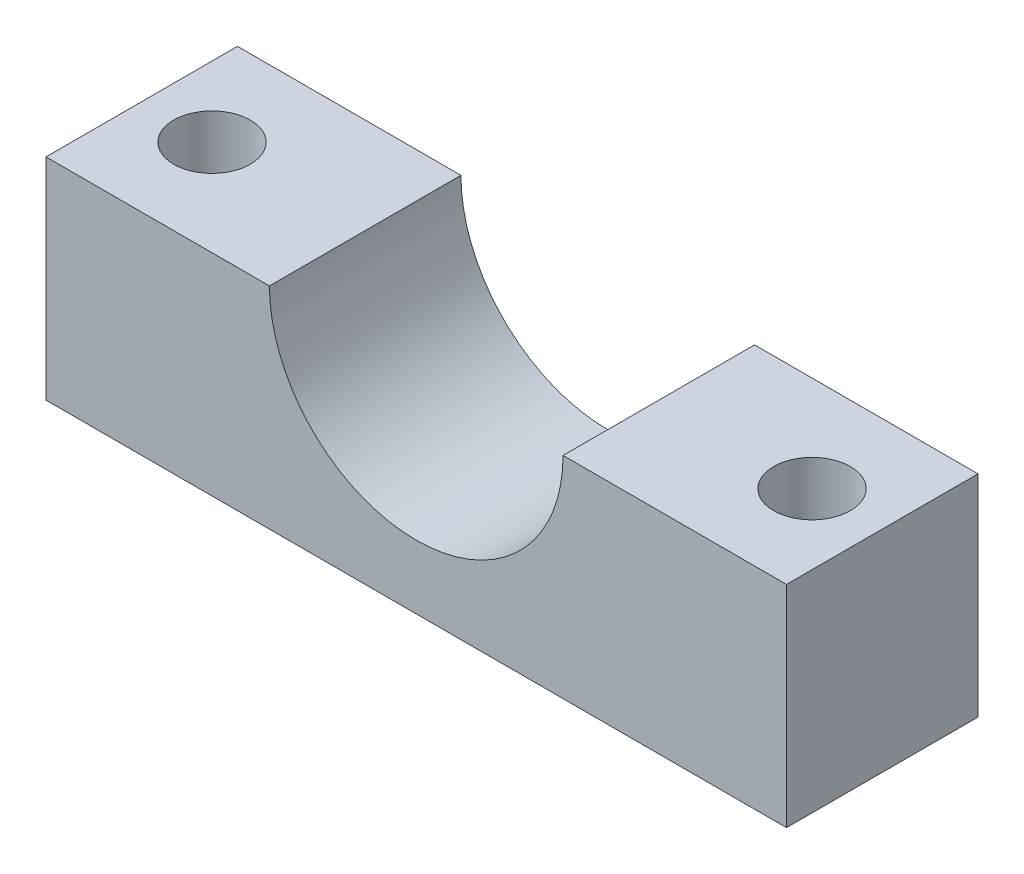
ISO-10303-21;
HEADER;
FILE_DESCRIPTION(('STEP AP214'),'2;1');
FILE_NAME('part.step','',(''),(''),'','','');
FILE_SCHEMA(('AUTOMOTIVE_DESIGN { 1 0 10303 214 1 1 1 1 }'));
ENDSEC;
DATA;
#1=APPLICATION_CONTEXT('core data for automotive mechanical design processes');
#2=APPLICATION_PROTOCOL_DEFINITION('international standard','automotive_design',2000,#1);
#3=PRODUCT_CONTEXT('',#1,'mechanical');
#4=PRODUCT('Part','Part','',(#3));
#5=PRODUCT_RELATED_PRODUCT_CATEGORY('part','',(#4));
#6=PRODUCT_DEFINITION_FORMATION('','',#4);
#7=PRODUCT_DEFINITION_CONTEXT('part definition',#1,'design');
#8=PRODUCT_DEFINITION('design','',#6,#7);
#9=PRODUCT_DEFINITION_SHAPE('','',#8);
#10=(LENGTH_UNIT() NAMED_UNIT(*) SI_UNIT(.MILLI.,.METRE.));
#11=(NAMED_UNIT(*) PLANE_ANGLE_UNIT() SI_UNIT($,.RADIAN.));
#12=(NAMED_UNIT(*) SI_UNIT($,.STERADIAN.) SOLID_ANGLE_UNIT());
#13=UNCERTAINTY_MEASURE_WITH_UNIT(LENGTH_MEASURE(1.E-05),#10,'distance_accuracy_value','');
#14=(GEOMETRIC_REPRESENTATION_CONTEXT(3) GLOBAL_UNCERTAINTY_ASSIGNED_CONTEXT((#13)) GLOBAL_UNIT_ASSIGNED_CONTEXT((#10,
#11,#12)) REPRESENTATION_CONTEXT('',''));
#15=CARTESIAN_POINT('',(0.,0.,0.));
#16=DIRECTION('',(0.,0.,1.));
#17=DIRECTION('',(1.,0.,0.));
#18=AXIS2_PLACEMENT_3D('',#15,#16,#17);
#19=CARTESIAN_POINT('',(0.,0.,15.));
#20=DIRECTION('',(0.,0.,-1.));
#21=DIRECTION('',(-1.,0.,0.));
#22=AXIS2_PLACEMENT_3D('',#19,#20,#21);
#23=CYLINDRICAL_SURFACE('',#22,11.5);
#24=CARTESIAN_POINT('',(0.,0.,0.));
#25=DIRECTION('',(0.,0.,-1.));
#26=DIRECTION('',(1.,0.,0.));
#27=AXIS2_PLACEMENT_3D('',#24,#25,#26);
#28=CIRCLE('',#27,11.5);
#29=CARTESIAN_POINT('',(11.5,0.,0.));
#30=VERTEX_POINT('',#29);
#31=CARTESIAN_POINT('',(-11.5,0.,0.));
#32=VERTEX_POINT('',#31);
#33=EDGE_CURVE('E124',#30,#32,#28,.T.);
#34=ORIENTED_EDGE('',*,*,#33,.T.);
#35=DIRECTION('',(0.,0.,-1.));
#36=VECTOR('',#35,1.);
#37=CARTESIAN_POINT('',(-11.5,0.,15.));
#38=LINE('',#37,#36);
#39=CARTESIAN_POINT('',(-11.5,0.,15.));
#40=VERTEX_POINT('',#39);
#41=EDGE_CURVE('E11',#40,#32,#38,.T.);
#42=ORIENTED_EDGE('',*,*,#41,.F.);
#43=CARTESIAN_POINT('',(0.,0.,15.));
#44=DIRECTION('',(0.,0.,-1.));
#45=DIRECTION('',(1.,0.,0.));
#46=AXIS2_PLACEMENT_3D('',#43,#44,#45);
#47=CIRCLE('',#46,11.5);
#48=CARTESIAN_POINT('',(11.5,0.,15.));
#49=VERTEX_POINT('',#48);
#50=EDGE_CURVE('E135',#49,#40,#47,.T.);
#51=ORIENTED_EDGE('',*,*,#50,.F.);
#52=DIRECTION('',(0.,0.,-1.));
#53=VECTOR('',#52,1.);
#54=CARTESIAN_POINT('',(11.5,0.,15.));
#55=LINE('',#54,#53);
#56=EDGE_CURVE('E120',#49,#30,#55,.T.);
#57=ORIENTED_EDGE('',*,*,#56,.T.);
#58=EDGE_LOOP('',(#34,#42,#51,#57));
#59=FACE_BOUND('',#58,.T.);
#60=ADVANCED_FACE('F37',(#59),#23,.F.);
#61=CARTESIAN_POINT('',(-11.5,0.,15.));
#62=DIRECTION('',(0.,-1.,0.));
#63=DIRECTION('',(1.,0.,0.));
#64=AXIS2_PLACEMENT_3D('',#61,#62,#63);
#65=PLANE('',#64);
#66=CARTESIAN_POINT('',(-23.5,0.,7.5));
#67=DIRECTION('',(0.,1.,0.));
#68=DIRECTION('',(0.,0.,1.));
#69=AXIS2_PLACEMENT_3D('',#66,#67,#68);
#70=CIRCLE('',#69,2.99999999999999);
#71=CARTESIAN_POINT('',(-23.5,0.,10.5));
#72=VERTEX_POINT('',#71);
#73=EDGE_CURVE('E255',#72,#72,#70,.T.);
#74=ORIENTED_EDGE('',*,*,#73,.F.);
#75=EDGE_LOOP('',(#74));
#76=FACE_BOUND('',#75,.T.);
#77=DIRECTION('',(-1.,0.,0.));
#78=VECTOR('',#77,1.);
#79=CARTESIAN_POINT('',(-11.5,0.,0.));
#80=LINE('',#79,#78);
#81=CARTESIAN_POINT('',(-29.,0.,0.));
#82=VERTEX_POINT('',#81);
#83=EDGE_CURVE('E127',#32,#82,#80,.T.);
#84=ORIENTED_EDGE('',*,*,#83,.T.);
#85=DIRECTION('',(0.,0.,-1.));
#86=VECTOR('',#85,1.);
#87=CARTESIAN_POINT('',(-29.,0.,15.));
#88=LINE('',#87,#86);
#89=CARTESIAN_POINT('',(-29.,0.,15.));
#90=VERTEX_POINT('',#89);
#91=EDGE_CURVE('E45',#90,#82,#88,.T.);
#92=ORIENTED_EDGE('',*,*,#91,.F.);
#93=DIRECTION('',(-1.,0.,0.));
#94=VECTOR('',#93,1.);
#95=CARTESIAN_POINT('',(-11.5,0.,15.));
#96=LINE('',#95,#94);
#97=EDGE_CURVE('E91',#40,#90,#96,.T.);
#98=ORIENTED_EDGE('',*,*,#97,.F.);
#99=ORIENTED_EDGE('',*,*,#41,.T.);
#100=EDGE_LOOP('',(#84,#92,#98,#99));
#101=FACE_BOUND('',#100,.T.);
#102=ADVANCED_FACE('F161',(#76,#101),#65,.F.);
#103=CARTESIAN_POINT('',(-29.,0.,15.));
#104=DIRECTION('',(1.,0.,0.));
#105=DIRECTION('',(0.,1.,0.));
#106=AXIS2_PLACEMENT_3D('',#103,#104,#105);
#107=PLANE('',#106);
#108=DIRECTION('',(0.,-1.,0.));
#109=VECTOR('',#108,1.);
#110=CARTESIAN_POINT('',(-29.,0.,0.));
#111=LINE('',#110,#109);
#112=CARTESIAN_POINT('',(-29.,-16.5,0.));
#113=VERTEX_POINT('',#112);
#114=EDGE_CURVE('E130',#82,#113,#111,.T.);
#115=ORIENTED_EDGE('',*,*,#114,.T.);
#116=DIRECTION('',(0.,0.,-1.));
#117=VECTOR('',#116,1.);
#118=CARTESIAN_POINT('',(-29.,-16.5,15.));
#119=LINE('',#118,#117);
#120=CARTESIAN_POINT('',(-29.,-16.5,15.));
#121=VERTEX_POINT('',#120);
#122=EDGE_CURVE('E115',#121,#113,#119,.T.);
#123=ORIENTED_EDGE('',*,*,#122,.F.);
#124=DIRECTION('',(0.,-1.,0.));
#125=VECTOR('',#124,1.);
#126=CARTESIAN_POINT('',(-29.,0.,15.));
#127=LINE('',#126,#125);
#128=EDGE_CURVE('E106',#90,#121,#127,.T.);
#129=ORIENTED_EDGE('',*,*,#128,.F.);
#130=ORIENTED_EDGE('',*,*,#91,.T.);
#131=EDGE_LOOP('',(#115,#123,#129,#130));
#132=FACE_BOUND('',#131,.T.);
#133=ADVANCED_FACE('F141',(#132),#107,.F.);
#134=CARTESIAN_POINT('',(-29.,-16.5,15.));
#135=DIRECTION('',(0.,1.,0.));
#136=DIRECTION('',(0.,0.,1.));
#137=AXIS2_PLACEMENT_3D('',#134,#135,#136);
#138=PLANE('',#137);
#139=DIRECTION('',(1.,0.,0.));
#140=VECTOR('',#139,1.);
#141=CARTESIAN_POINT('',(-29.,-16.5,0.));
#142=LINE('',#141,#140);
#143=CARTESIAN_POINT('',(29.,-16.5,0.));
#144=VERTEX_POINT('',#143);
#145=EDGE_CURVE('E114',#113,#144,#142,.T.);
#146=ORIENTED_EDGE('',*,*,#145,.T.);
#147=DIRECTION('',(0.,0.,-1.));
#148=VECTOR('',#147,1.);
#149=CARTESIAN_POINT('',(29.,-16.5,15.));
#150=LINE('',#149,#148);
#151=CARTESIAN_POINT('',(29.,-16.5,15.));
#152=VERTEX_POINT('',#151);
#153=EDGE_CURVE('E111',#152,#144,#150,.T.);
#154=ORIENTED_EDGE('',*,*,#153,.F.);
#155=DIRECTION('',(1.,0.,0.));
#156=VECTOR('',#155,1.);
#157=CARTESIAN_POINT('',(-29.,-16.5,15.));
#158=LINE('',#157,#156);
#159=EDGE_CURVE('E100',#121,#152,#158,.T.);
#160=ORIENTED_EDGE('',*,*,#159,.F.);
#161=ORIENTED_EDGE('',*,*,#122,.T.);
#162=EDGE_LOOP('',(#146,#154,#160,#161));
#163=FACE_BOUND('',#162,.T.);
#164=ADVANCED_FACE('F112',(#163),#138,.F.);
#165=CARTESIAN_POINT('',(29.,-16.5,15.));
#166=DIRECTION('',(-1.,0.,0.));
#167=DIRECTION('',(0.,0.,1.));
#168=AXIS2_PLACEMENT_3D('',#165,#166,#167);
#169=PLANE('',#168);
#170=DIRECTION('',(0.,1.,0.));
#171=VECTOR('',#170,1.);
#172=CARTESIAN_POINT('',(29.,-16.5,0.));
#173=LINE('',#172,#171);
#174=CARTESIAN_POINT('',(29.,0.,0.));
#175=VERTEX_POINT('',#174);
#176=EDGE_CURVE('E77',#144,#175,#173,.T.);
#177=ORIENTED_EDGE('',*,*,#176,.T.);
#178=DIRECTION('',(0.,0.,-1.));
#179=VECTOR('',#178,1.);
#180=CARTESIAN_POINT('',(29.,0.,15.));
#181=LINE('',#180,#179);
#182=CARTESIAN_POINT('',(29.,0.,15.));
#183=VERTEX_POINT('',#182);
#184=EDGE_CURVE('E116',#183,#175,#181,.T.);
#185=ORIENTED_EDGE('',*,*,#184,.F.);
#186=DIRECTION('',(0.,1.,0.));
#187=VECTOR('',#186,1.);
#188=CARTESIAN_POINT('',(29.,-16.5,15.));
#189=LINE('',#188,#187);
#190=EDGE_CURVE('E104',#152,#183,#189,.T.);
#191=ORIENTED_EDGE('',*,*,#190,.F.);
#192=ORIENTED_EDGE('',*,*,#153,.T.);
#193=EDGE_LOOP('',(#177,#185,#191,#192));
#194=FACE_BOUND('',#193,.T.);
#195=ADVANCED_FACE('F118',(#194),#169,.F.);
#196=CARTESIAN_POINT('',(29.,0.,15.));
#197=DIRECTION('',(0.,-1.,0.));
#198=DIRECTION('',(1.,0.,0.));
#199=AXIS2_PLACEMENT_3D('',#196,#197,#198);
#200=PLANE('',#199);
#201=CARTESIAN_POINT('',(23.5,0.,7.5));
#202=DIRECTION('',(0.,1.,0.));
#203=DIRECTION('',(0.,0.,1.));
#204=AXIS2_PLACEMENT_3D('',#201,#202,#203);
#205=CIRCLE('',#204,2.99999999999999);
#206=CARTESIAN_POINT('',(23.5,0.,10.5));
#207=VERTEX_POINT('',#206);
#208=EDGE_CURVE('E253',#207,#207,#205,.T.);
#209=ORIENTED_EDGE('',*,*,#208,.F.);
#210=EDGE_LOOP('',(#209));
#211=FACE_BOUND('',#210,.T.);
#212=DIRECTION('',(-1.,0.,0.));
#213=VECTOR('',#212,1.);
#214=CARTESIAN_POINT('',(29.,0.,0.));
#215=LINE('',#214,#213);
#216=EDGE_CURVE('E83',#175,#30,#215,.T.);
#217=ORIENTED_EDGE('',*,*,#216,.T.);
#218=ORIENTED_EDGE('',*,*,#56,.F.);
#219=DIRECTION('',(-1.,0.,0.));
#220=VECTOR('',#219,1.);
#221=CARTESIAN_POINT('',(29.,0.,15.));
#222=LINE('',#221,#220);
#223=EDGE_CURVE('E53',#183,#49,#222,.T.);
#224=ORIENTED_EDGE('',*,*,#223,.F.);
#225=ORIENTED_EDGE('',*,*,#184,.T.);
#226=EDGE_LOOP('',(#217,#218,#224,#225));
#227=FACE_BOUND('',#226,.T.);
#228=ADVANCED_FACE('F148',(#211,#227),#200,.F.);
#229=CARTESIAN_POINT('',(0.,0.,15.));
#230=DIRECTION('',(0.,0.,1.));
#231=DIRECTION('',(1.,0.,0.));
#232=AXIS2_PLACEMENT_3D('',#229,#230,#231);
#233=PLANE('',#232);
#234=ORIENTED_EDGE('',*,*,#50,.T.);
#235=ORIENTED_EDGE('',*,*,#97,.T.);
#236=ORIENTED_EDGE('',*,*,#128,.T.);
#237=ORIENTED_EDGE('',*,*,#159,.T.);
#238=ORIENTED_EDGE('',*,*,#190,.T.);
#239=ORIENTED_EDGE('',*,*,#223,.T.);
#240=EDGE_LOOP('',(#234,#235,#236,#237,#238,#239));
#241=FACE_BOUND('',#240,.T.);
#242=ADVANCED_FACE('F102',(#241),#233,.T.);
#243=CARTESIAN_POINT('',(0.,0.,0.));
#244=DIRECTION('',(0.,0.,1.));
#245=DIRECTION('',(1.,0.,0.));
#246=AXIS2_PLACEMENT_3D('',#243,#244,#245);
#247=PLANE('',#246);
#248=ORIENTED_EDGE('',*,*,#33,.F.);
#249=ORIENTED_EDGE('',*,*,#216,.F.);
#250=ORIENTED_EDGE('',*,*,#176,.F.);
#251=ORIENTED_EDGE('',*,*,#145,.F.);
#252=ORIENTED_EDGE('',*,*,#114,.F.);
#253=ORIENTED_EDGE('',*,*,#83,.F.);
#254=EDGE_LOOP('',(#248,#249,#250,#251,#252,#253));
#255=FACE_BOUND('',#254,.T.);
#256=ADVANCED_FACE('F144',(#255),#247,.F.);
#257=CARTESIAN_POINT('',(-23.5,-10.,7.5));
#258=DIRECTION('',(0.,1.,0.));
#259=DIRECTION('',(0.,0.,1.));
#260=AXIS2_PLACEMENT_3D('',#257,#258,#259);
#261=CONICAL_SURFACE('',#260,3.,1.02974425867665);
#262=CARTESIAN_POINT('',(-23.5,-11.8025818570827,7.5));
#263=VERTEX_POINT('',#262);
#264=VERTEX_LOOP('',#263);
#265=FACE_BOUND('',#264,.T.);
#266=CARTESIAN_POINT('',(-23.5,-10.,7.5));
#267=DIRECTION('',(0.,1.,0.));
#268=DIRECTION('',(0.,0.,1.));
#269=AXIS2_PLACEMENT_3D('',#266,#267,#268);
#270=CIRCLE('',#269,3.);
#271=CARTESIAN_POINT('',(-23.5,-10.,10.5));
#272=VERTEX_POINT('',#271);
#273=EDGE_CURVE('E128',#272,#272,#270,.T.);
#274=ORIENTED_EDGE('',*,*,#273,.T.);
#275=EDGE_LOOP('',(#274));
#276=FACE_BOUND('',#275,.T.);
#277=ADVANCED_FACE('F196',(#265,#276),#261,.F.);
#278=CARTESIAN_POINT('',(-23.5,0.,7.5));
#279=DIRECTION('',(0.,1.,0.));
#280=DIRECTION('',(0.,0.,1.));
#281=AXIS2_PLACEMENT_3D('',#278,#279,#280);
#282=CYLINDRICAL_SURFACE('',#281,2.99999999999999);
#283=ORIENTED_EDGE('',*,*,#273,.F.);
#284=EDGE_LOOP('',(#283));
#285=FACE_BOUND('',#284,.T.);
#286=ORIENTED_EDGE('',*,*,#73,.T.);
#287=EDGE_LOOP('',(#286));
#288=FACE_BOUND('',#287,.T.);
#289=ADVANCED_FACE('F211',(#285,#288),#282,.F.);
#290=CARTESIAN_POINT('',(23.5,-10.,7.5));
#291=DIRECTION('',(0.,1.,0.));
#292=DIRECTION('',(0.,0.,1.));
#293=AXIS2_PLACEMENT_3D('',#290,#291,#292);
#294=CONICAL_SURFACE('',#293,3.,1.02974425867665);
#295=CARTESIAN_POINT('',(23.5,-11.8025818570827,7.5));
#296=VERTEX_POINT('',#295);
#297=VERTEX_LOOP('',#296);
#298=FACE_BOUND('',#297,.T.);
#299=CARTESIAN_POINT('',(23.5,-10.,7.5));
#300=DIRECTION('',(0.,1.,0.));
#301=DIRECTION('',(0.,0.,1.));
#302=AXIS2_PLACEMENT_3D('',#299,#300,#301);
#303=CIRCLE('',#302,3.);
#304=CARTESIAN_POINT('',(23.5,-10.,10.5));
#305=VERTEX_POINT('',#304);
#306=EDGE_CURVE('E251',#305,#305,#303,.T.);
#307=ORIENTED_EDGE('',*,*,#306,.T.);
#308=EDGE_LOOP('',(#307));
#309=FACE_BOUND('',#308,.T.);
#310=ADVANCED_FACE('F220',(#298,#309),#294,.F.);
#311=CARTESIAN_POINT('',(23.5,0.,7.5));
#312=DIRECTION('',(0.,1.,0.));
#313=DIRECTION('',(0.,0.,1.));
#314=AXIS2_PLACEMENT_3D('',#311,#312,#313);
#315=CYLINDRICAL_SURFACE('',#314,2.99999999999999);
#316=ORIENTED_EDGE('',*,*,#306,.F.);
#317=EDGE_LOOP('',(#316));
#318=FACE_BOUND('',#317,.T.);
#319=ORIENTED_EDGE('',*,*,#208,.T.);
#320=EDGE_LOOP('',(#319));
#321=FACE_BOUND('',#320,.T.);
#322=ADVANCED_FACE('F234',(#318,#321),#315,.F.);
#323=CLOSED_SHELL('',(#60,#102,#133,#164,#195,#228,#242,#256,#277,#289,#310,#322));
#324=MANIFOLD_SOLID_BREP('B2',#323);
#325=ADVANCED_BREP_SHAPE_REPRESENTATION('',(#18,#324),#14);
#326=SHAPE_DEFINITION_REPRESENTATION(#9,#325);
ENDSEC;
END-ISO-10303-21;
